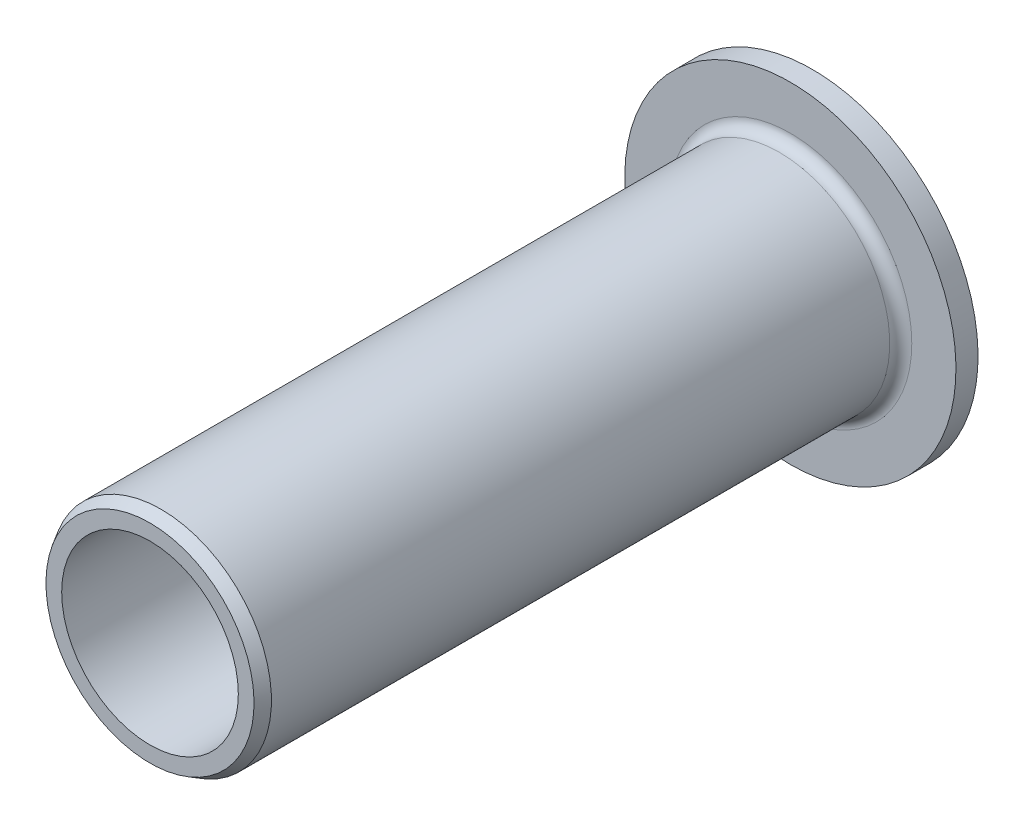
ISO-10303-21;
HEADER;
FILE_DESCRIPTION(('STEP AP214'),'2;1');
FILE_NAME('part.step','',(''),(''),'','','');
FILE_SCHEMA(('AUTOMOTIVE_DESIGN { 1 0 10303 214 1 1 1 1 }'));
ENDSEC;
DATA;
#1=APPLICATION_CONTEXT('core data for automotive mechanical design processes');
#2=APPLICATION_PROTOCOL_DEFINITION('international standard','automotive_design',2000,#1);
#3=PRODUCT_CONTEXT('',#1,'mechanical');
#4=PRODUCT('Part','Part','',(#3));
#5=PRODUCT_RELATED_PRODUCT_CATEGORY('part','',(#4));
#6=PRODUCT_DEFINITION_FORMATION('','',#4);
#7=PRODUCT_DEFINITION_CONTEXT('part definition',#1,'design');
#8=PRODUCT_DEFINITION('design','',#6,#7);
#9=PRODUCT_DEFINITION_SHAPE('','',#8);
#10=(LENGTH_UNIT() NAMED_UNIT(*) SI_UNIT(.MILLI.,.METRE.));
#11=(NAMED_UNIT(*) PLANE_ANGLE_UNIT() SI_UNIT($,.RADIAN.));
#12=(NAMED_UNIT(*) SI_UNIT($,.STERADIAN.) SOLID_ANGLE_UNIT());
#13=UNCERTAINTY_MEASURE_WITH_UNIT(LENGTH_MEASURE(1.E-05),#10,'distance_accuracy_value','');
#14=(GEOMETRIC_REPRESENTATION_CONTEXT(3) GLOBAL_UNCERTAINTY_ASSIGNED_CONTEXT((#13)) GLOBAL_UNIT_ASSIGNED_CONTEXT((#10,
#11,#12)) REPRESENTATION_CONTEXT('',''));
#15=CARTESIAN_POINT('',(0.,0.,0.));
#16=DIRECTION('',(0.,0.,1.));
#17=DIRECTION('',(1.,0.,0.));
#18=AXIS2_PLACEMENT_3D('',#15,#16,#17);
#19=CARTESIAN_POINT('',(5.75,0.,0.));
#20=DIRECTION('',(0.,0.,-1.));
#21=DIRECTION('',(0.,1.,0.));
#22=AXIS2_PLACEMENT_3D('',#19,#20,#21);
#23=PLANE('',#22);
#24=CARTESIAN_POINT('',(0.,0.,0.));
#25=DIRECTION('',(0.,0.,1.));
#26=DIRECTION('',(0.,-1.,0.));
#27=AXIS2_PLACEMENT_3D('',#24,#25,#26);
#28=CIRCLE('',#27,4.);
#29=CARTESIAN_POINT('',(0.,-4.,0.));
#30=VERTEX_POINT('',#29);
#31=EDGE_CURVE('E41',#30,#30,#28,.F.);
#32=ORIENTED_EDGE('',*,*,#31,.F.);
#33=EDGE_LOOP('',(#32));
#34=FACE_BOUND('',#33,.T.);
#35=CARTESIAN_POINT('',(0.,0.,0.));
#36=DIRECTION('',(0.,0.,1.));
#37=DIRECTION('',(0.,-1.,0.));
#38=AXIS2_PLACEMENT_3D('',#35,#36,#37);
#39=CIRCLE('',#38,7.5);
#40=CARTESIAN_POINT('',(0.,-7.5,0.));
#41=VERTEX_POINT('',#40);
#42=EDGE_CURVE('E16',#41,#41,#39,.T.);
#43=ORIENTED_EDGE('',*,*,#42,.F.);
#44=EDGE_LOOP('',(#43));
#45=FACE_BOUND('',#44,.T.);
#46=ADVANCED_FACE('F13',(#34,#45),#23,.T.);
#47=CARTESIAN_POINT('',(0.,0.,0.5));
#48=DIRECTION('',(0.,0.,1.));
#49=DIRECTION('',(0.,-1.,0.));
#50=AXIS2_PLACEMENT_3D('',#47,#48,#49);
#51=CYLINDRICAL_SURFACE('',#50,7.5);
#52=CARTESIAN_POINT('',(0.,0.,1.));
#53=DIRECTION('',(0.,0.,1.));
#54=DIRECTION('',(0.,-1.,0.));
#55=AXIS2_PLACEMENT_3D('',#52,#53,#54);
#56=CIRCLE('',#55,7.5);
#57=CARTESIAN_POINT('',(0.,-7.5,1.));
#58=VERTEX_POINT('',#57);
#59=EDGE_CURVE('E39',#58,#58,#56,.T.);
#60=ORIENTED_EDGE('',*,*,#59,.F.);
#61=EDGE_LOOP('',(#60));
#62=FACE_BOUND('',#61,.T.);
#63=ORIENTED_EDGE('',*,*,#42,.T.);
#64=EDGE_LOOP('',(#63));
#65=FACE_BOUND('',#64,.T.);
#66=ADVANCED_FACE('F48',(#62,#65),#51,.T.);
#67=CARTESIAN_POINT('',(0.,0.,0.));
#68=DIRECTION('',(0.,0.,1.));
#69=DIRECTION('',(0.,-1.,0.));
#70=AXIS2_PLACEMENT_3D('',#67,#68,#69);
#71=CYLINDRICAL_SURFACE('',#70,4.);
#72=ORIENTED_EDGE('',*,*,#31,.T.);
#73=EDGE_LOOP('',(#72));
#74=FACE_BOUND('',#73,.T.);
#75=CARTESIAN_POINT('',(0.,0.,30.));
#76=DIRECTION('',(0.,0.,1.));
#77=DIRECTION('',(0.,-1.,0.));
#78=AXIS2_PLACEMENT_3D('',#75,#76,#77);
#79=CIRCLE('',#78,4.);
#80=CARTESIAN_POINT('',(0.,-4.,30.));
#81=VERTEX_POINT('',#80);
#82=EDGE_CURVE('E36',#81,#81,#79,.F.);
#83=ORIENTED_EDGE('',*,*,#82,.F.);
#84=EDGE_LOOP('',(#83));
#85=FACE_BOUND('',#84,.T.);
#86=ADVANCED_FACE('F56',(#74,#85),#71,.F.);
#87=CARTESIAN_POINT('',(6.5,0.,1.));
#88=DIRECTION('',(0.,0.,1.));
#89=DIRECTION('',(0.,-1.,0.));
#90=AXIS2_PLACEMENT_3D('',#87,#88,#89);
#91=PLANE('',#90);
#92=ORIENTED_EDGE('',*,*,#59,.T.);
#93=EDGE_LOOP('',(#92));
#94=FACE_BOUND('',#93,.T.);
#95=CARTESIAN_POINT('',(0.,0.,1.));
#96=DIRECTION('',(0.,0.,1.));
#97=DIRECTION('',(1.,0.,0.));
#98=AXIS2_PLACEMENT_3D('',#95,#96,#97);
#99=CIRCLE('',#98,5.5);
#100=CARTESIAN_POINT('',(5.5,0.,1.));
#101=VERTEX_POINT('',#100);
#102=EDGE_CURVE('E35',#101,#101,#99,.T.);
#103=ORIENTED_EDGE('',*,*,#102,.F.);
#104=EDGE_LOOP('',(#103));
#105=FACE_BOUND('',#104,.T.);
#106=ADVANCED_FACE('F84',(#94,#105),#91,.T.);
#107=CARTESIAN_POINT('',(4.35566243270259,0.,30.));
#108=DIRECTION('',(0.,0.,1.));
#109=DIRECTION('',(0.,-1.,0.));
#110=AXIS2_PLACEMENT_3D('',#107,#108,#109);
#111=PLANE('',#110);
#112=CARTESIAN_POINT('',(0.,0.,30.0000000000296));
#113=DIRECTION('',(0.,0.,-1.));
#114=DIRECTION('',(0.,1.,0.));
#115=AXIS2_PLACEMENT_3D('',#112,#113,#114);
#116=CIRCLE('',#115,4.71132486535453);
#117=CARTESIAN_POINT('',(0.,4.71132486535453,30.0000000000296));
#118=VERTEX_POINT('',#117);
#119=EDGE_CURVE('E25',#118,#118,#116,.T.);
#120=ORIENTED_EDGE('',*,*,#119,.F.);
#121=EDGE_LOOP('',(#120));
#122=FACE_BOUND('',#121,.T.);
#123=ORIENTED_EDGE('',*,*,#82,.T.);
#124=EDGE_LOOP('',(#123));
#125=FACE_BOUND('',#124,.T.);
#126=ADVANCED_FACE('F73',(#122,#125),#111,.T.);
#127=CARTESIAN_POINT('',(0.,0.,1.5));
#128=DIRECTION('',(0.,0.,1.));
#129=DIRECTION('',(0.,-1.,0.));
#130=AXIS2_PLACEMENT_3D('',#127,#128,#129);
#131=TOROIDAL_SURFACE('',#130,5.5,0.5);
#132=ORIENTED_EDGE('',*,*,#102,.T.);
#133=EDGE_LOOP('',(#132));
#134=FACE_BOUND('',#133,.T.);
#135=CARTESIAN_POINT('',(0.,0.,1.5));
#136=DIRECTION('',(0.,0.,1.));
#137=DIRECTION('',(0.,-1.,0.));
#138=AXIS2_PLACEMENT_3D('',#135,#136,#137);
#139=CIRCLE('',#138,5.);
#140=CARTESIAN_POINT('',(0.,-5.,1.5));
#141=VERTEX_POINT('',#140);
#142=EDGE_CURVE('E20',#141,#141,#139,.T.);
#143=ORIENTED_EDGE('',*,*,#142,.F.);
#144=EDGE_LOOP('',(#143));
#145=FACE_BOUND('',#144,.T.);
#146=ADVANCED_FACE('F66',(#134,#145),#131,.F.);
#147=CARTESIAN_POINT('',(0.,0.,29.4999999999277));
#148=DIRECTION('',(0.,0.,-1.));
#149=DIRECTION('',(0.,1.,0.));
#150=AXIS2_PLACEMENT_3D('',#147,#148,#149);
#151=CONICAL_SURFACE('',#150,4.99999999999545,0.523598775579252);
#152=ORIENTED_EDGE('',*,*,#119,.T.);
#153=EDGE_LOOP('',(#152));
#154=FACE_BOUND('',#153,.T.);
#155=CARTESIAN_POINT('',(0.,0.,29.5));
#156=DIRECTION('',(0.,0.,1.));
#157=DIRECTION('',(0.,-1.,0.));
#158=AXIS2_PLACEMENT_3D('',#155,#156,#157);
#159=CIRCLE('',#158,5.);
#160=CARTESIAN_POINT('',(0.,-5.,29.5));
#161=VERTEX_POINT('',#160);
#162=EDGE_CURVE('E9',#161,#161,#159,.F.);
#163=ORIENTED_EDGE('',*,*,#162,.F.);
#164=EDGE_LOOP('',(#163));
#165=FACE_BOUND('',#164,.T.);
#166=ADVANCED_FACE('F60',(#154,#165),#151,.T.);
#167=CARTESIAN_POINT('',(0.,0.,15.5));
#168=DIRECTION('',(0.,0.,1.));
#169=DIRECTION('',(0.,-1.,0.));
#170=AXIS2_PLACEMENT_3D('',#167,#168,#169);
#171=CYLINDRICAL_SURFACE('',#170,5.);
#172=ORIENTED_EDGE('',*,*,#142,.T.);
#173=EDGE_LOOP('',(#172));
#174=FACE_BOUND('',#173,.T.);
#175=ORIENTED_EDGE('',*,*,#162,.T.);
#176=EDGE_LOOP('',(#175));
#177=FACE_BOUND('',#176,.T.);
#178=ADVANCED_FACE('F58',(#174,#177),#171,.T.);
#179=CLOSED_SHELL('',(#46,#66,#86,#106,#126,#146,#166,#178));
#180=MANIFOLD_SOLID_BREP('B1',#179);
#181=ADVANCED_BREP_SHAPE_REPRESENTATION('',(#18,#180),#14);
#182=SHAPE_DEFINITION_REPRESENTATION(#9,#181);
ENDSEC;
END-ISO-10303-21;
